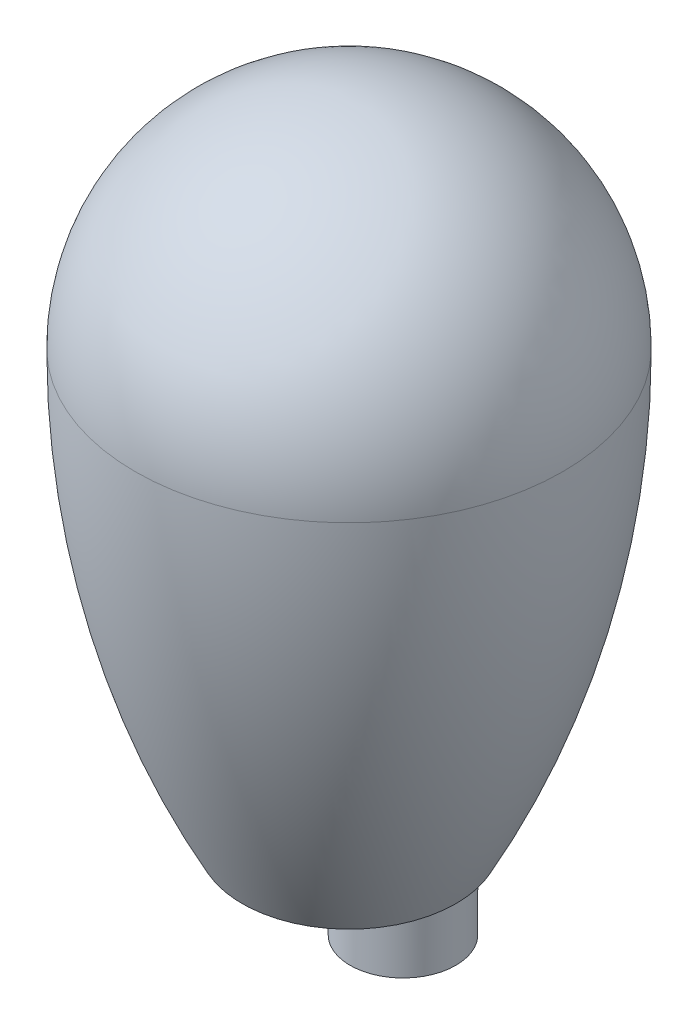
ISO-10303-21;
HEADER;
FILE_DESCRIPTION(('STEP AP214'),'2;1');
FILE_NAME('part.step','',(''),(''),'','','');
FILE_SCHEMA(('AUTOMOTIVE_DESIGN { 1 0 10303 214 1 1 1 1 }'));
ENDSEC;
DATA;
#1=APPLICATION_CONTEXT('core data for automotive mechanical design processes');
#2=APPLICATION_PROTOCOL_DEFINITION('international standard','automotive_design',2000,#1);
#3=PRODUCT_CONTEXT('',#1,'mechanical');
#4=PRODUCT('Part','Part','',(#3));
#5=PRODUCT_RELATED_PRODUCT_CATEGORY('part','',(#4));
#6=PRODUCT_DEFINITION_FORMATION('','',#4);
#7=PRODUCT_DEFINITION_CONTEXT('part definition',#1,'design');
#8=PRODUCT_DEFINITION('design','',#6,#7);
#9=PRODUCT_DEFINITION_SHAPE('','',#8);
#10=(LENGTH_UNIT() NAMED_UNIT(*) SI_UNIT(.MILLI.,.METRE.));
#11=(NAMED_UNIT(*) PLANE_ANGLE_UNIT() SI_UNIT($,.RADIAN.));
#12=(NAMED_UNIT(*) SI_UNIT($,.STERADIAN.) SOLID_ANGLE_UNIT());
#13=UNCERTAINTY_MEASURE_WITH_UNIT(LENGTH_MEASURE(1.E-05),#10,'distance_accuracy_value','');
#14=(GEOMETRIC_REPRESENTATION_CONTEXT(3) GLOBAL_UNCERTAINTY_ASSIGNED_CONTEXT((#13)) GLOBAL_UNIT_ASSIGNED_CONTEXT((#10,
#11,#12)) REPRESENTATION_CONTEXT('',''));
#15=CARTESIAN_POINT('',(0.,0.,0.));
#16=DIRECTION('',(0.,0.,1.));
#17=DIRECTION('',(1.,0.,0.));
#18=AXIS2_PLACEMENT_3D('',#15,#16,#17);
#19=CARTESIAN_POINT('',(0.,0.,0.));
#20=DIRECTION('',(0.,-1.,0.));
#21=DIRECTION('',(0.,0.,-1.));
#22=AXIS2_PLACEMENT_3D('',#19,#20,#21);
#23=PLANE('',#22);
#24=CARTESIAN_POINT('',(0.,0.,0.));
#25=DIRECTION('',(0.,-1.,0.));
#26=DIRECTION('',(0.,0.,-1.));
#27=AXIS2_PLACEMENT_3D('',#24,#25,#26);
#28=CIRCLE('',#27,0.500000000000001);
#29=CARTESIAN_POINT('',(0.500000000000001,0.,0.));
#30=VERTEX_POINT('',#29);
#31=CARTESIAN_POINT('',(-0.500000000000001,0.,0.));
#32=VERTEX_POINT('',#31);
#33=EDGE_CURVE('E43',#30,#32,#28,.T.);
#34=ORIENTED_EDGE('',*,*,#33,.T.);
#35=CARTESIAN_POINT('',(-0.252500000000001,0.,0.));
#36=DIRECTION('',(0.,-1.,0.));
#37=DIRECTION('',(0.,0.,-1.));
#38=AXIS2_PLACEMENT_3D('',#35,#36,#37);
#39=CIRCLE('',#38,0.2475);
#40=EDGE_CURVE('E48',#32,#32,#39,.T.);
#41=ORIENTED_EDGE('',*,*,#40,.F.);
#42=EDGE_CURVE('E53',#32,#30,#28,.T.);
#43=ORIENTED_EDGE('',*,*,#42,.T.);
#44=CARTESIAN_POINT('',(0.252500000000001,0.,0.));
#45=DIRECTION('',(0.,-1.,0.));
#46=DIRECTION('',(0.,0.,-1.));
#47=AXIS2_PLACEMENT_3D('',#44,#45,#46);
#48=CIRCLE('',#47,0.2475);
#49=EDGE_CURVE('E57',#30,#30,#48,.T.);
#50=ORIENTED_EDGE('',*,*,#49,.F.);
#51=EDGE_LOOP('',(#34,#41,#43,#50));
#52=FACE_BOUND('',#51,.T.);
#53=ADVANCED_FACE('F35',(#52),#23,.T.);
#54=CARTESIAN_POINT('',(0.,2.,0.));
#55=DIRECTION('',(0.,-1.,0.));
#56=DIRECTION('',(1.,0.,0.));
#57=AXIS2_PLACEMENT_3D('',#54,#55,#56);
#58=SPHERICAL_SURFACE('',#57,1.);
#59=CARTESIAN_POINT('',(0.,2.,0.));
#60=DIRECTION('',(0.,-1.,0.));
#61=DIRECTION('',(0.,0.,-1.));
#62=AXIS2_PLACEMENT_3D('',#59,#60,#61);
#63=CIRCLE('',#62,1.);
#64=CARTESIAN_POINT('',(0.,2.,-1.));
#65=VERTEX_POINT('',#64);
#66=EDGE_CURVE('E11',#65,#65,#63,.T.);
#67=ORIENTED_EDGE('',*,*,#66,.F.);
#68=EDGE_LOOP('',(#67));
#69=FACE_BOUND('',#68,.T.);
#70=ADVANCED_FACE('F37',(#69),#58,.T.);
#71=CARTESIAN_POINT('',(0.,2.,0.));
#72=DIRECTION('',(0.,-1.,0.));
#73=DIRECTION('',(0.,0.,-1.));
#74=AXIS2_PLACEMENT_3D('',#71,#72,#73);
#75=DEGENERATE_TOROIDAL_SURFACE('',#74,3.25,4.25,.F.);
#76=ORIENTED_EDGE('',*,*,#66,.T.);
#77=EDGE_LOOP('',(#76));
#78=FACE_BOUND('',#77,.T.);
#79=ORIENTED_EDGE('',*,*,#33,.F.);
#80=ORIENTED_EDGE('',*,*,#42,.F.);
#81=EDGE_LOOP('',(#79,#80));
#82=FACE_BOUND('',#81,.T.);
#83=ADVANCED_FACE('F60',(#78,#82),#75,.F.);
#84=CARTESIAN_POINT('',(0.252500000000001,-0.25,0.));
#85=DIRECTION('',(0.,1.,0.));
#86=DIRECTION('',(0.,0.,1.));
#87=AXIS2_PLACEMENT_3D('',#84,#85,#86);
#88=CYLINDRICAL_SURFACE('',#87,0.2475);
#89=CARTESIAN_POINT('',(0.252500000000001,-0.25,0.));
#90=DIRECTION('',(0.,-1.,0.));
#91=DIRECTION('',(0.,0.,-1.));
#92=AXIS2_PLACEMENT_3D('',#89,#90,#91);
#93=CIRCLE('',#92,0.2475);
#94=CARTESIAN_POINT('',(0.252500000000001,-0.25,-0.2475));
#95=VERTEX_POINT('',#94);
#96=EDGE_CURVE('E59',#95,#95,#93,.T.);
#97=ORIENTED_EDGE('',*,*,#96,.F.);
#98=EDGE_LOOP('',(#97));
#99=FACE_BOUND('',#98,.T.);
#100=ORIENTED_EDGE('',*,*,#49,.T.);
#101=EDGE_LOOP('',(#100));
#102=FACE_BOUND('',#101,.T.);
#103=ADVANCED_FACE('F81',(#99,#102),#88,.T.);
#104=CARTESIAN_POINT('',(0.252500000000001,-0.25,0.));
#105=DIRECTION('',(0.,-1.,0.));
#106=DIRECTION('',(0.,0.,-1.));
#107=AXIS2_PLACEMENT_3D('',#104,#105,#106);
#108=PLANE('',#107);
#109=ORIENTED_EDGE('',*,*,#96,.T.);
#110=EDGE_LOOP('',(#109));
#111=FACE_BOUND('',#110,.T.);
#112=ADVANCED_FACE('F74',(#111),#108,.T.);
#113=CARTESIAN_POINT('',(-0.252500000000001,-0.25,0.));
#114=DIRECTION('',(0.,1.,0.));
#115=DIRECTION('',(0.,0.,1.));
#116=AXIS2_PLACEMENT_3D('',#113,#114,#115);
#117=CYLINDRICAL_SURFACE('',#116,0.2475);
#118=CARTESIAN_POINT('',(-0.252500000000001,-0.25,0.));
#119=DIRECTION('',(0.,-1.,0.));
#120=DIRECTION('',(0.,0.,-1.));
#121=AXIS2_PLACEMENT_3D('',#118,#119,#120);
#122=CIRCLE('',#121,0.2475);
#123=CARTESIAN_POINT('',(-0.252500000000001,-0.25,-0.2475));
#124=VERTEX_POINT('',#123);
#125=EDGE_CURVE('E63',#124,#124,#122,.T.);
#126=ORIENTED_EDGE('',*,*,#125,.F.);
#127=EDGE_LOOP('',(#126));
#128=FACE_BOUND('',#127,.T.);
#129=ORIENTED_EDGE('',*,*,#40,.T.);
#130=EDGE_LOOP('',(#129));
#131=FACE_BOUND('',#130,.T.);
#132=ADVANCED_FACE('F72',(#128,#131),#117,.T.);
#133=CARTESIAN_POINT('',(-0.252500000000001,-0.25,0.));
#134=DIRECTION('',(0.,-1.,0.));
#135=DIRECTION('',(0.,0.,-1.));
#136=AXIS2_PLACEMENT_3D('',#133,#134,#135);
#137=PLANE('',#136);
#138=ORIENTED_EDGE('',*,*,#125,.T.);
#139=EDGE_LOOP('',(#138));
#140=FACE_BOUND('',#139,.T.);
#141=ADVANCED_FACE('F70',(#140),#137,.T.);
#142=CLOSED_SHELL('',(#53,#70,#83,#103,#112,#132,#141));
#143=MANIFOLD_SOLID_BREP('B2',#142);
#144=ADVANCED_BREP_SHAPE_REPRESENTATION('',(#18,#143),#14);
#145=SHAPE_DEFINITION_REPRESENTATION(#9,#144);
ENDSEC;
END-ISO-10303-21;
